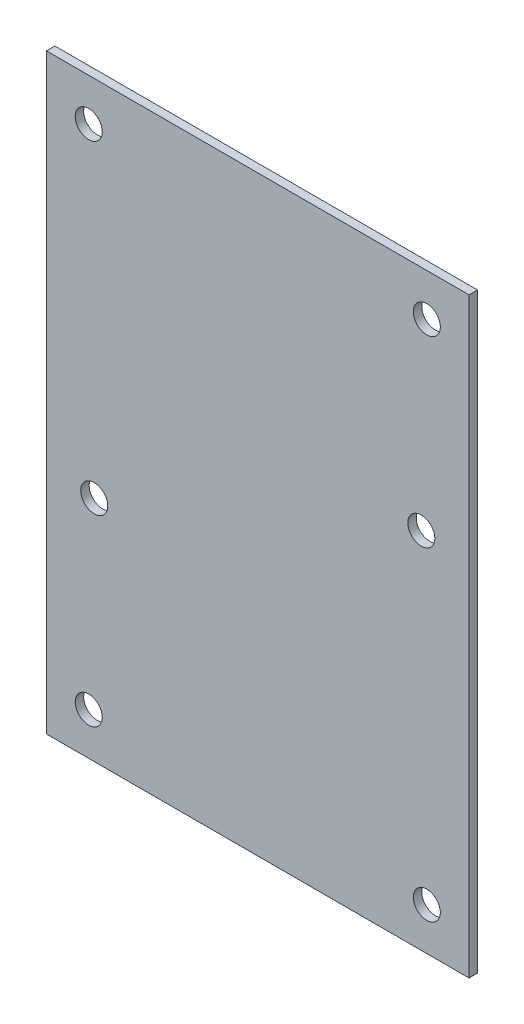
ISO-10303-21;
HEADER;
FILE_DESCRIPTION(('STEP AP214'),'2;1');
FILE_NAME('part.step','',(''),(''),'','','');
FILE_SCHEMA(('AUTOMOTIVE_DESIGN { 1 0 10303 214 1 1 1 1 }'));
ENDSEC;
DATA;
#1=APPLICATION_CONTEXT('core data for automotive mechanical design processes');
#2=APPLICATION_PROTOCOL_DEFINITION('international standard','automotive_design',2000,#1);
#3=PRODUCT_CONTEXT('',#1,'mechanical');
#4=PRODUCT('Part','Part','',(#3));
#5=PRODUCT_RELATED_PRODUCT_CATEGORY('part','',(#4));
#6=PRODUCT_DEFINITION_FORMATION('','',#4);
#7=PRODUCT_DEFINITION_CONTEXT('part definition',#1,'design');
#8=PRODUCT_DEFINITION('design','',#6,#7);
#9=PRODUCT_DEFINITION_SHAPE('','',#8);
#10=(LENGTH_UNIT() NAMED_UNIT(*) SI_UNIT(.MILLI.,.METRE.));
#11=(NAMED_UNIT(*) PLANE_ANGLE_UNIT() SI_UNIT($,.RADIAN.));
#12=(NAMED_UNIT(*) SI_UNIT($,.STERADIAN.) SOLID_ANGLE_UNIT());
#13=UNCERTAINTY_MEASURE_WITH_UNIT(LENGTH_MEASURE(1.E-05),#10,'distance_accuracy_value','');
#14=(GEOMETRIC_REPRESENTATION_CONTEXT(3) GLOBAL_UNCERTAINTY_ASSIGNED_CONTEXT((#13)) GLOBAL_UNIT_ASSIGNED_CONTEXT((#10,
#11,#12)) REPRESENTATION_CONTEXT('',''));
#15=CARTESIAN_POINT('',(0.,0.,0.));
#16=DIRECTION('',(0.,0.,1.));
#17=DIRECTION('',(1.,0.,0.));
#18=AXIS2_PLACEMENT_3D('',#15,#16,#17);
#19=CARTESIAN_POINT('',(0.,0.,0.));
#20=DIRECTION('',(0.,0.,1.));
#21=DIRECTION('',(1.,0.,0.));
#22=AXIS2_PLACEMENT_3D('',#19,#20,#21);
#23=PLANE('',#22);
#24=CARTESIAN_POINT('',(-20.,30.,0.));
#25=DIRECTION('',(0.,0.,1.));
#26=DIRECTION('',(1.,0.,0.));
#27=AXIS2_PLACEMENT_3D('',#24,#25,#26);
#28=CIRCLE('',#27,1.6);
#29=CARTESIAN_POINT('',(-18.4,30.,0.));
#30=VERTEX_POINT('',#29);
#31=EDGE_CURVE('E95',#30,#30,#28,.T.);
#32=ORIENTED_EDGE('',*,*,#31,.T.);
#33=EDGE_LOOP('',(#32));
#34=FACE_BOUND('',#33,.T.);
#35=CARTESIAN_POINT('',(20.,30.,0.));
#36=DIRECTION('',(0.,0.,1.));
#37=DIRECTION('',(1.,0.,0.));
#38=AXIS2_PLACEMENT_3D('',#35,#36,#37);
#39=CIRCLE('',#38,1.6);
#40=CARTESIAN_POINT('',(21.6,30.,0.));
#41=VERTEX_POINT('',#40);
#42=EDGE_CURVE('E99',#41,#41,#39,.T.);
#43=ORIENTED_EDGE('',*,*,#42,.T.);
#44=EDGE_LOOP('',(#43));
#45=FACE_BOUND('',#44,.T.);
#46=CARTESIAN_POINT('',(-20.,-30.,0.));
#47=DIRECTION('',(0.,0.,1.));
#48=DIRECTION('',(1.,0.,0.));
#49=AXIS2_PLACEMENT_3D('',#46,#47,#48);
#50=CIRCLE('',#49,1.6);
#51=CARTESIAN_POINT('',(-18.4,-30.,0.));
#52=VERTEX_POINT('',#51);
#53=EDGE_CURVE('E102',#52,#52,#50,.T.);
#54=ORIENTED_EDGE('',*,*,#53,.T.);
#55=EDGE_LOOP('',(#54));
#56=FACE_BOUND('',#55,.T.);
#57=CARTESIAN_POINT('',(20.,-30.,0.));
#58=DIRECTION('',(0.,0.,1.));
#59=DIRECTION('',(1.,0.,0.));
#60=AXIS2_PLACEMENT_3D('',#57,#58,#59);
#61=CIRCLE('',#60,1.6);
#62=CARTESIAN_POINT('',(21.6,-30.,0.));
#63=VERTEX_POINT('',#62);
#64=EDGE_CURVE('E105',#63,#63,#61,.T.);
#65=ORIENTED_EDGE('',*,*,#64,.T.);
#66=EDGE_LOOP('',(#65));
#67=FACE_BOUND('',#66,.T.);
#68=CARTESIAN_POINT('',(19.35,8.0150324319194,0.));
#69=DIRECTION('',(0.,0.,-1.));
#70=DIRECTION('',(-1.,0.,0.));
#71=AXIS2_PLACEMENT_3D('',#68,#69,#70);
#72=CIRCLE('',#71,1.6);
#73=CARTESIAN_POINT('',(17.75,8.0150324319194,0.));
#74=VERTEX_POINT('',#73);
#75=EDGE_CURVE('E107',#74,#74,#72,.F.);
#76=ORIENTED_EDGE('',*,*,#75,.T.);
#77=EDGE_LOOP('',(#76));
#78=FACE_BOUND('',#77,.T.);
#79=CARTESIAN_POINT('',(-19.35,-8.0150324319194,0.));
#80=DIRECTION('',(0.,0.,-1.));
#81=DIRECTION('',(-1.,0.,0.));
#82=AXIS2_PLACEMENT_3D('',#79,#80,#81);
#83=CIRCLE('',#82,1.6);
#84=CARTESIAN_POINT('',(-20.95,-8.0150324319194,0.));
#85=VERTEX_POINT('',#84);
#86=EDGE_CURVE('E19',#85,#85,#83,.F.);
#87=ORIENTED_EDGE('',*,*,#86,.T.);
#88=EDGE_LOOP('',(#87));
#89=FACE_BOUND('',#88,.T.);
#90=DIRECTION('',(0.,1.,0.));
#91=VECTOR('',#90,1.);
#92=CARTESIAN_POINT('',(25.,35.,0.));
#93=LINE('',#92,#91);
#94=CARTESIAN_POINT('',(25.,-35.,0.));
#95=VERTEX_POINT('',#94);
#96=CARTESIAN_POINT('',(25.,35.,0.));
#97=VERTEX_POINT('',#96);
#98=EDGE_CURVE('E59',#95,#97,#93,.T.);
#99=ORIENTED_EDGE('',*,*,#98,.F.);
#100=DIRECTION('',(1.,0.,0.));
#101=VECTOR('',#100,1.);
#102=CARTESIAN_POINT('',(25.,-35.,0.));
#103=LINE('',#102,#101);
#104=CARTESIAN_POINT('',(-25.,-35.,0.));
#105=VERTEX_POINT('',#104);
#106=EDGE_CURVE('E114',#105,#95,#103,.T.);
#107=ORIENTED_EDGE('',*,*,#106,.F.);
#108=DIRECTION('',(0.,-1.,0.));
#109=VECTOR('',#108,1.);
#110=CARTESIAN_POINT('',(-25.,-35.,0.));
#111=LINE('',#110,#109);
#112=CARTESIAN_POINT('',(-25.,35.,0.));
#113=VERTEX_POINT('',#112);
#114=EDGE_CURVE('E69',#113,#105,#111,.T.);
#115=ORIENTED_EDGE('',*,*,#114,.F.);
#116=DIRECTION('',(1.,0.,0.));
#117=VECTOR('',#116,1.);
#118=CARTESIAN_POINT('',(-25.,35.,0.));
#119=LINE('',#118,#117);
#120=EDGE_CURVE('E54',#97,#113,#119,.F.);
#121=ORIENTED_EDGE('',*,*,#120,.F.);
#122=EDGE_LOOP('',(#99,#107,#115,#121));
#123=FACE_BOUND('',#122,.T.);
#124=ADVANCED_FACE('F16',(#34,#45,#56,#67,#78,#89,#123),#23,.F.);
#125=CARTESIAN_POINT('',(25.,35.,0.));
#126=DIRECTION('',(1.,0.,0.));
#127=DIRECTION('',(0.,1.,0.));
#128=AXIS2_PLACEMENT_3D('',#125,#126,#127);
#129=PLANE('',#128);
#130=ORIENTED_EDGE('',*,*,#98,.T.);
#131=DIRECTION('',(0.,0.,1.));
#132=VECTOR('',#131,1.);
#133=CARTESIAN_POINT('',(25.,35.,0.));
#134=LINE('',#133,#132);
#135=CARTESIAN_POINT('',(25.,35.,1.));
#136=VERTEX_POINT('',#135);
#137=EDGE_CURVE('E61',#136,#97,#134,.F.);
#138=ORIENTED_EDGE('',*,*,#137,.F.);
#139=DIRECTION('',(0.,1.,0.));
#140=VECTOR('',#139,1.);
#141=CARTESIAN_POINT('',(25.,0.,1.));
#142=LINE('',#141,#140);
#143=CARTESIAN_POINT('',(25.,-35.,1.));
#144=VERTEX_POINT('',#143);
#145=EDGE_CURVE('E98',#144,#136,#142,.T.);
#146=ORIENTED_EDGE('',*,*,#145,.F.);
#147=DIRECTION('',(0.,0.,1.));
#148=VECTOR('',#147,1.);
#149=CARTESIAN_POINT('',(25.,-35.,0.));
#150=LINE('',#149,#148);
#151=EDGE_CURVE('E64',#95,#144,#150,.T.);
#152=ORIENTED_EDGE('',*,*,#151,.F.);
#153=EDGE_LOOP('',(#130,#138,#146,#152));
#154=FACE_BOUND('',#153,.T.);
#155=ADVANCED_FACE('F60',(#154),#129,.T.);
#156=CARTESIAN_POINT('',(-25.,35.,0.));
#157=DIRECTION('',(0.,1.,0.));
#158=DIRECTION('',(0.,0.,1.));
#159=AXIS2_PLACEMENT_3D('',#156,#157,#158);
#160=PLANE('',#159);
#161=ORIENTED_EDGE('',*,*,#120,.T.);
#162=DIRECTION('',(0.,0.,1.));
#163=VECTOR('',#162,1.);
#164=CARTESIAN_POINT('',(-25.,35.,0.));
#165=LINE('',#164,#163);
#166=CARTESIAN_POINT('',(-25.,35.,1.));
#167=VERTEX_POINT('',#166);
#168=EDGE_CURVE('E71',#167,#113,#165,.F.);
#169=ORIENTED_EDGE('',*,*,#168,.F.);
#170=DIRECTION('',(1.,0.,0.));
#171=VECTOR('',#170,1.);
#172=CARTESIAN_POINT('',(0.,35.,1.));
#173=LINE('',#172,#171);
#174=EDGE_CURVE('E75',#136,#167,#173,.F.);
#175=ORIENTED_EDGE('',*,*,#174,.F.);
#176=ORIENTED_EDGE('',*,*,#137,.T.);
#177=EDGE_LOOP('',(#161,#169,#175,#176));
#178=FACE_BOUND('',#177,.T.);
#179=ADVANCED_FACE('F73',(#178),#160,.T.);
#180=CARTESIAN_POINT('',(-25.,-35.,0.));
#181=DIRECTION('',(-1.,0.,0.));
#182=DIRECTION('',(0.,-1.,0.));
#183=AXIS2_PLACEMENT_3D('',#180,#181,#182);
#184=PLANE('',#183);
#185=ORIENTED_EDGE('',*,*,#114,.T.);
#186=DIRECTION('',(0.,0.,1.));
#187=VECTOR('',#186,1.);
#188=CARTESIAN_POINT('',(-25.,-35.,0.));
#189=LINE('',#188,#187);
#190=CARTESIAN_POINT('',(-25.,-35.,1.));
#191=VERTEX_POINT('',#190);
#192=EDGE_CURVE('E34',#191,#105,#189,.F.);
#193=ORIENTED_EDGE('',*,*,#192,.F.);
#194=DIRECTION('',(0.,1.,0.));
#195=VECTOR('',#194,1.);
#196=CARTESIAN_POINT('',(-25.,0.,1.));
#197=LINE('',#196,#195);
#198=EDGE_CURVE('E125',#167,#191,#197,.F.);
#199=ORIENTED_EDGE('',*,*,#198,.F.);
#200=ORIENTED_EDGE('',*,*,#168,.T.);
#201=EDGE_LOOP('',(#185,#193,#199,#200));
#202=FACE_BOUND('',#201,.T.);
#203=ADVANCED_FACE('F123',(#202),#184,.T.);
#204=CARTESIAN_POINT('',(25.,-35.,0.));
#205=DIRECTION('',(0.,-1.,0.));
#206=DIRECTION('',(1.,0.,0.));
#207=AXIS2_PLACEMENT_3D('',#204,#205,#206);
#208=PLANE('',#207);
#209=ORIENTED_EDGE('',*,*,#106,.T.);
#210=ORIENTED_EDGE('',*,*,#151,.T.);
#211=DIRECTION('',(1.,0.,0.));
#212=VECTOR('',#211,1.);
#213=CARTESIAN_POINT('',(0.,-35.,1.));
#214=LINE('',#213,#212);
#215=EDGE_CURVE('E94',#191,#144,#214,.T.);
#216=ORIENTED_EDGE('',*,*,#215,.F.);
#217=ORIENTED_EDGE('',*,*,#192,.T.);
#218=EDGE_LOOP('',(#209,#210,#216,#217));
#219=FACE_BOUND('',#218,.T.);
#220=ADVANCED_FACE('F130',(#219),#208,.T.);
#221=CARTESIAN_POINT('',(-19.35,-8.0150324319194,1.));
#222=DIRECTION('',(0.,0.,-1.));
#223=DIRECTION('',(-1.,0.,0.));
#224=AXIS2_PLACEMENT_3D('',#221,#222,#223);
#225=CYLINDRICAL_SURFACE('',#224,1.6);
#226=ORIENTED_EDGE('',*,*,#86,.F.);
#227=EDGE_LOOP('',(#226));
#228=FACE_BOUND('',#227,.T.);
#229=CARTESIAN_POINT('',(-19.35,-8.0150324319194,1.));
#230=DIRECTION('',(0.,0.,-1.));
#231=DIRECTION('',(-1.,0.,0.));
#232=AXIS2_PLACEMENT_3D('',#229,#230,#231);
#233=CIRCLE('',#232,1.6);
#234=CARTESIAN_POINT('',(-20.95,-8.0150324319194,1.));
#235=VERTEX_POINT('',#234);
#236=EDGE_CURVE('E91',#235,#235,#233,.T.);
#237=ORIENTED_EDGE('',*,*,#236,.F.);
#238=EDGE_LOOP('',(#237));
#239=FACE_BOUND('',#238,.T.);
#240=ADVANCED_FACE('F132',(#228,#239),#225,.F.);
#241=CARTESIAN_POINT('',(19.35,8.0150324319194,1.));
#242=DIRECTION('',(0.,0.,-1.));
#243=DIRECTION('',(-1.,0.,0.));
#244=AXIS2_PLACEMENT_3D('',#241,#242,#243);
#245=CYLINDRICAL_SURFACE('',#244,1.6);
#246=ORIENTED_EDGE('',*,*,#75,.F.);
#247=EDGE_LOOP('',(#246));
#248=FACE_BOUND('',#247,.T.);
#249=CARTESIAN_POINT('',(19.35,8.0150324319194,1.));
#250=DIRECTION('',(0.,0.,-1.));
#251=DIRECTION('',(-1.,0.,0.));
#252=AXIS2_PLACEMENT_3D('',#249,#250,#251);
#253=CIRCLE('',#252,1.6);
#254=CARTESIAN_POINT('',(17.75,8.0150324319194,1.));
#255=VERTEX_POINT('',#254);
#256=EDGE_CURVE('E88',#255,#255,#253,.T.);
#257=ORIENTED_EDGE('',*,*,#256,.F.);
#258=EDGE_LOOP('',(#257));
#259=FACE_BOUND('',#258,.T.);
#260=ADVANCED_FACE('F139',(#248,#259),#245,.F.);
#261=CARTESIAN_POINT('',(20.,-30.,0.));
#262=DIRECTION('',(0.,0.,1.));
#263=DIRECTION('',(1.,0.,0.));
#264=AXIS2_PLACEMENT_3D('',#261,#262,#263);
#265=CYLINDRICAL_SURFACE('',#264,1.6);
#266=CARTESIAN_POINT('',(20.,-30.,1.));
#267=DIRECTION('',(0.,0.,1.));
#268=DIRECTION('',(1.,0.,0.));
#269=AXIS2_PLACEMENT_3D('',#266,#267,#268);
#270=CIRCLE('',#269,1.6);
#271=CARTESIAN_POINT('',(21.6,-30.,1.));
#272=VERTEX_POINT('',#271);
#273=EDGE_CURVE('E85',#272,#272,#270,.F.);
#274=ORIENTED_EDGE('',*,*,#273,.F.);
#275=EDGE_LOOP('',(#274));
#276=FACE_BOUND('',#275,.T.);
#277=ORIENTED_EDGE('',*,*,#64,.F.);
#278=EDGE_LOOP('',(#277));
#279=FACE_BOUND('',#278,.T.);
#280=ADVANCED_FACE('F161',(#276,#279),#265,.F.);
#281=CARTESIAN_POINT('',(-20.,-30.,0.));
#282=DIRECTION('',(0.,0.,1.));
#283=DIRECTION('',(1.,0.,0.));
#284=AXIS2_PLACEMENT_3D('',#281,#282,#283);
#285=CYLINDRICAL_SURFACE('',#284,1.6);
#286=CARTESIAN_POINT('',(-20.,-30.,1.));
#287=DIRECTION('',(0.,0.,1.));
#288=DIRECTION('',(1.,0.,0.));
#289=AXIS2_PLACEMENT_3D('',#286,#287,#288);
#290=CIRCLE('',#289,1.6);
#291=CARTESIAN_POINT('',(-18.4,-30.,1.));
#292=VERTEX_POINT('',#291);
#293=EDGE_CURVE('E82',#292,#292,#290,.F.);
#294=ORIENTED_EDGE('',*,*,#293,.F.);
#295=EDGE_LOOP('',(#294));
#296=FACE_BOUND('',#295,.T.);
#297=ORIENTED_EDGE('',*,*,#53,.F.);
#298=EDGE_LOOP('',(#297));
#299=FACE_BOUND('',#298,.T.);
#300=ADVANCED_FACE('F157',(#296,#299),#285,.F.);
#301=CARTESIAN_POINT('',(20.,30.,0.));
#302=DIRECTION('',(0.,0.,1.));
#303=DIRECTION('',(1.,0.,0.));
#304=AXIS2_PLACEMENT_3D('',#301,#302,#303);
#305=CYLINDRICAL_SURFACE('',#304,1.6);
#306=CARTESIAN_POINT('',(20.,30.,1.));
#307=DIRECTION('',(0.,0.,1.));
#308=DIRECTION('',(1.,0.,0.));
#309=AXIS2_PLACEMENT_3D('',#306,#307,#308);
#310=CIRCLE('',#309,1.6);
#311=CARTESIAN_POINT('',(21.6,30.,1.));
#312=VERTEX_POINT('',#311);
#313=EDGE_CURVE('E25',#312,#312,#310,.F.);
#314=ORIENTED_EDGE('',*,*,#313,.F.);
#315=EDGE_LOOP('',(#314));
#316=FACE_BOUND('',#315,.T.);
#317=ORIENTED_EDGE('',*,*,#42,.F.);
#318=EDGE_LOOP('',(#317));
#319=FACE_BOUND('',#318,.T.);
#320=ADVANCED_FACE('F150',(#316,#319),#305,.F.);
#321=CARTESIAN_POINT('',(-20.,30.,0.));
#322=DIRECTION('',(0.,0.,1.));
#323=DIRECTION('',(1.,0.,0.));
#324=AXIS2_PLACEMENT_3D('',#321,#322,#323);
#325=CYLINDRICAL_SURFACE('',#324,1.6);
#326=CARTESIAN_POINT('',(-20.,30.,1.));
#327=DIRECTION('',(0.,0.,1.));
#328=DIRECTION('',(1.,0.,0.));
#329=AXIS2_PLACEMENT_3D('',#326,#327,#328);
#330=CIRCLE('',#329,1.6);
#331=CARTESIAN_POINT('',(-18.4,30.,1.));
#332=VERTEX_POINT('',#331);
#333=EDGE_CURVE('E11',#332,#332,#330,.F.);
#334=ORIENTED_EDGE('',*,*,#333,.F.);
#335=EDGE_LOOP('',(#334));
#336=FACE_BOUND('',#335,.T.);
#337=ORIENTED_EDGE('',*,*,#31,.F.);
#338=EDGE_LOOP('',(#337));
#339=FACE_BOUND('',#338,.T.);
#340=ADVANCED_FACE('F144',(#336,#339),#325,.F.);
#341=CARTESIAN_POINT('',(0.,0.,1.));
#342=DIRECTION('',(0.,0.,1.));
#343=DIRECTION('',(1.,0.,0.));
#344=AXIS2_PLACEMENT_3D('',#341,#342,#343);
#345=PLANE('',#344);
#346=ORIENTED_EDGE('',*,*,#333,.T.);
#347=EDGE_LOOP('',(#346));
#348=FACE_BOUND('',#347,.T.);
#349=ORIENTED_EDGE('',*,*,#313,.T.);
#350=EDGE_LOOP('',(#349));
#351=FACE_BOUND('',#350,.T.);
#352=ORIENTED_EDGE('',*,*,#293,.T.);
#353=EDGE_LOOP('',(#352));
#354=FACE_BOUND('',#353,.T.);
#355=ORIENTED_EDGE('',*,*,#273,.T.);
#356=EDGE_LOOP('',(#355));
#357=FACE_BOUND('',#356,.T.);
#358=ORIENTED_EDGE('',*,*,#256,.T.);
#359=EDGE_LOOP('',(#358));
#360=FACE_BOUND('',#359,.T.);
#361=ORIENTED_EDGE('',*,*,#236,.T.);
#362=EDGE_LOOP('',(#361));
#363=FACE_BOUND('',#362,.T.);
#364=ORIENTED_EDGE('',*,*,#198,.T.);
#365=ORIENTED_EDGE('',*,*,#215,.T.);
#366=ORIENTED_EDGE('',*,*,#145,.T.);
#367=ORIENTED_EDGE('',*,*,#174,.T.);
#368=EDGE_LOOP('',(#364,#365,#366,#367));
#369=FACE_BOUND('',#368,.T.);
#370=ADVANCED_FACE('F128',(#348,#351,#354,#357,#360,#363,#369),#345,.T.);
#371=CLOSED_SHELL('',(#124,#155,#179,#203,#220,#240,#260,#280,#300,#320,#340,#370));
#372=MANIFOLD_SOLID_BREP('B1',#371);
#373=ADVANCED_BREP_SHAPE_REPRESENTATION('',(#18,#372),#14);
#374=SHAPE_DEFINITION_REPRESENTATION(#9,#373);
ENDSEC;
END-ISO-10303-21;
